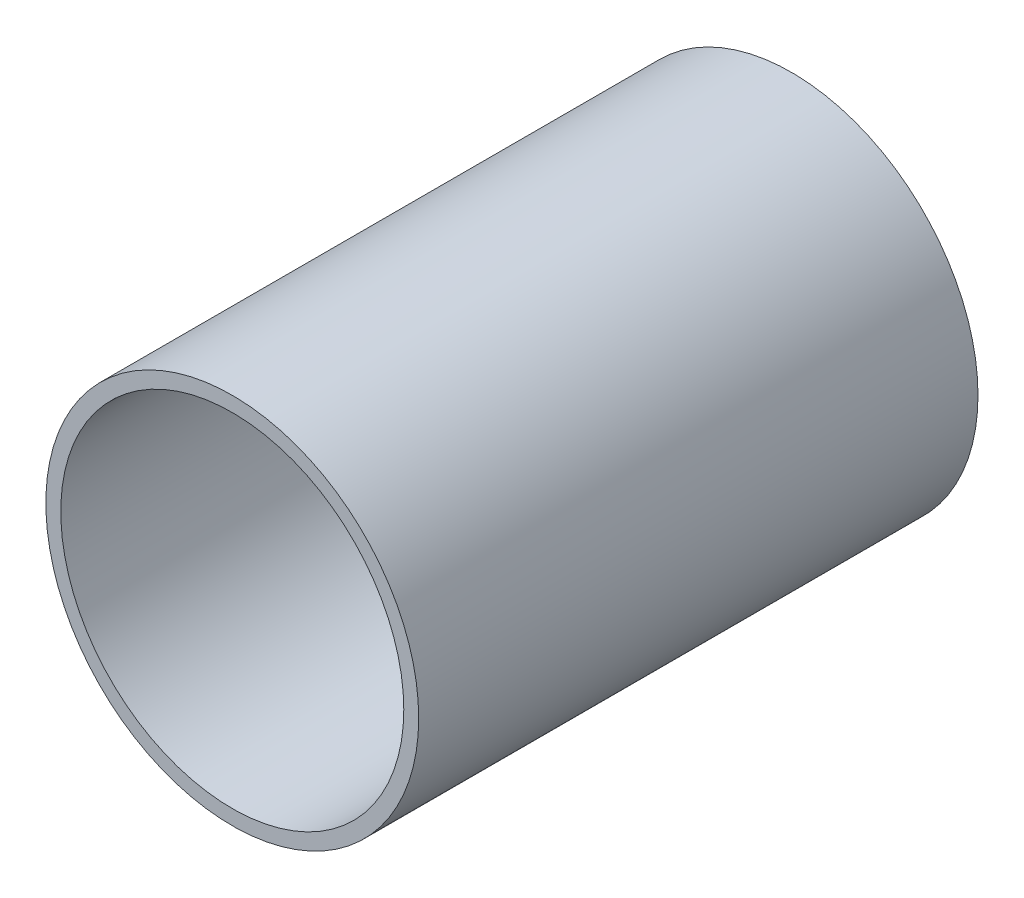
ISO-10303-21;
HEADER;
FILE_DESCRIPTION(('STEP AP214'),'2;1');
FILE_NAME('part.step','',(''),(''),'','','');
FILE_SCHEMA(('AUTOMOTIVE_DESIGN { 1 0 10303 214 1 1 1 1 }'));
ENDSEC;
DATA;
#1=APPLICATION_CONTEXT('core data for automotive mechanical design processes');
#2=APPLICATION_PROTOCOL_DEFINITION('international standard','automotive_design',2000,#1);
#3=PRODUCT_CONTEXT('',#1,'mechanical');
#4=PRODUCT('Part','Part','',(#3));
#5=PRODUCT_RELATED_PRODUCT_CATEGORY('part','',(#4));
#6=PRODUCT_DEFINITION_FORMATION('','',#4);
#7=PRODUCT_DEFINITION_CONTEXT('part definition',#1,'design');
#8=PRODUCT_DEFINITION('design','',#6,#7);
#9=PRODUCT_DEFINITION_SHAPE('','',#8);
#10=(LENGTH_UNIT() NAMED_UNIT(*) SI_UNIT(.MILLI.,.METRE.));
#11=(NAMED_UNIT(*) PLANE_ANGLE_UNIT() SI_UNIT($,.RADIAN.));
#12=(NAMED_UNIT(*) SI_UNIT($,.STERADIAN.) SOLID_ANGLE_UNIT());
#13=UNCERTAINTY_MEASURE_WITH_UNIT(LENGTH_MEASURE(1.E-05),#10,'distance_accuracy_value','');
#14=(GEOMETRIC_REPRESENTATION_CONTEXT(3) GLOBAL_UNCERTAINTY_ASSIGNED_CONTEXT((#13)) GLOBAL_UNIT_ASSIGNED_CONTEXT((#10,
#11,#12)) REPRESENTATION_CONTEXT('',''));
#15=CARTESIAN_POINT('',(0.,0.,0.));
#16=DIRECTION('',(0.,0.,1.));
#17=DIRECTION('',(1.,0.,0.));
#18=AXIS2_PLACEMENT_3D('',#15,#16,#17);
#19=CARTESIAN_POINT('',(0.,0.,30.));
#20=DIRECTION('',(0.,0.,-1.));
#21=DIRECTION('',(-1.,0.,0.));
#22=AXIS2_PLACEMENT_3D('',#19,#20,#21);
#23=CYLINDRICAL_SURFACE('',#22,10.);
#24=CARTESIAN_POINT('',(0.,0.,30.));
#25=DIRECTION('',(0.,0.,1.));
#26=DIRECTION('',(1.,0.,0.));
#27=AXIS2_PLACEMENT_3D('',#24,#25,#26);
#28=CIRCLE('',#27,10.);
#29=CARTESIAN_POINT('',(10.,0.,30.));
#30=VERTEX_POINT('',#29);
#31=EDGE_CURVE('E10',#30,#30,#28,.T.);
#32=ORIENTED_EDGE('',*,*,#31,.F.);
#33=EDGE_LOOP('',(#32));
#34=FACE_BOUND('',#33,.T.);
#35=CARTESIAN_POINT('',(0.,0.,0.));
#36=DIRECTION('',(0.,0.,1.));
#37=DIRECTION('',(1.,0.,0.));
#38=AXIS2_PLACEMENT_3D('',#35,#36,#37);
#39=CIRCLE('',#38,10.);
#40=CARTESIAN_POINT('',(10.,0.,0.));
#41=VERTEX_POINT('',#40);
#42=EDGE_CURVE('E42',#41,#41,#39,.T.);
#43=ORIENTED_EDGE('',*,*,#42,.T.);
#44=EDGE_LOOP('',(#43));
#45=FACE_BOUND('',#44,.T.);
#46=ADVANCED_FACE('F35',(#34,#45),#23,.T.);
#47=CARTESIAN_POINT('',(0.,0.,30.));
#48=DIRECTION('',(0.,0.,1.));
#49=DIRECTION('',(1.,0.,0.));
#50=AXIS2_PLACEMENT_3D('',#47,#48,#49);
#51=PLANE('',#50);
#52=CARTESIAN_POINT('',(0.,0.,30.));
#53=DIRECTION('',(0.,0.,1.));
#54=DIRECTION('',(1.,0.,0.));
#55=AXIS2_PLACEMENT_3D('',#52,#53,#54);
#56=CIRCLE('',#55,9.2);
#57=CARTESIAN_POINT('',(9.2,0.,30.));
#58=VERTEX_POINT('',#57);
#59=EDGE_CURVE('E81',#58,#58,#56,.T.);
#60=ORIENTED_EDGE('',*,*,#59,.F.);
#61=EDGE_LOOP('',(#60));
#62=FACE_BOUND('',#61,.T.);
#63=ORIENTED_EDGE('',*,*,#31,.T.);
#64=EDGE_LOOP('',(#63));
#65=FACE_BOUND('',#64,.T.);
#66=ADVANCED_FACE('F108',(#62,#65),#51,.T.);
#67=CARTESIAN_POINT('',(0.,0.,0.));
#68=DIRECTION('',(0.,0.,1.));
#69=DIRECTION('',(1.,0.,0.));
#70=AXIS2_PLACEMENT_3D('',#67,#68,#69);
#71=PLANE('',#70);
#72=CARTESIAN_POINT('',(0.,-5.,0.));
#73=DIRECTION('',(0.,0.,1.));
#74=DIRECTION('',(1.,0.,0.));
#75=AXIS2_PLACEMENT_3D('',#72,#73,#74);
#76=CIRCLE('',#75,0.5);
#77=CARTESIAN_POINT('',(0.499999999999983,-5.,0.));
#78=VERTEX_POINT('',#77);
#79=EDGE_CURVE('E57',#78,#78,#76,.T.);
#80=ORIENTED_EDGE('',*,*,#79,.T.);
#81=EDGE_LOOP('',(#80));
#82=FACE_BOUND('',#81,.T.);
#83=CARTESIAN_POINT('',(-5.,0.,0.));
#84=DIRECTION('',(0.,0.,1.));
#85=DIRECTION('',(1.,0.,0.));
#86=AXIS2_PLACEMENT_3D('',#83,#84,#85);
#87=CIRCLE('',#86,0.5);
#88=CARTESIAN_POINT('',(-4.5,0.,0.));
#89=VERTEX_POINT('',#88);
#90=EDGE_CURVE('E63',#89,#89,#87,.T.);
#91=ORIENTED_EDGE('',*,*,#90,.T.);
#92=EDGE_LOOP('',(#91));
#93=FACE_BOUND('',#92,.T.);
#94=CARTESIAN_POINT('',(0.,5.,0.));
#95=DIRECTION('',(0.,0.,1.));
#96=DIRECTION('',(1.,0.,0.));
#97=AXIS2_PLACEMENT_3D('',#94,#95,#96);
#98=CIRCLE('',#97,0.5);
#99=CARTESIAN_POINT('',(0.500000000000052,5.,0.));
#100=VERTEX_POINT('',#99);
#101=EDGE_CURVE('E60',#100,#100,#98,.T.);
#102=ORIENTED_EDGE('',*,*,#101,.T.);
#103=EDGE_LOOP('',(#102));
#104=FACE_BOUND('',#103,.T.);
#105=CARTESIAN_POINT('',(5.,0.,0.));
#106=DIRECTION('',(0.,0.,1.));
#107=DIRECTION('',(1.,0.,0.));
#108=AXIS2_PLACEMENT_3D('',#105,#106,#107);
#109=CIRCLE('',#108,0.5);
#110=CARTESIAN_POINT('',(5.5,0.,0.));
#111=VERTEX_POINT('',#110);
#112=EDGE_CURVE('E56',#111,#111,#109,.T.);
#113=ORIENTED_EDGE('',*,*,#112,.T.);
#114=EDGE_LOOP('',(#113));
#115=FACE_BOUND('',#114,.T.);
#116=CARTESIAN_POINT('',(0.,0.,0.));
#117=DIRECTION('',(0.,0.,1.));
#118=DIRECTION('',(1.,0.,0.));
#119=AXIS2_PLACEMENT_3D('',#116,#117,#118);
#120=CIRCLE('',#119,2.5);
#121=CARTESIAN_POINT('',(2.5,0.,0.));
#122=VERTEX_POINT('',#121);
#123=EDGE_CURVE('E50',#122,#122,#120,.T.);
#124=ORIENTED_EDGE('',*,*,#123,.T.);
#125=EDGE_LOOP('',(#124));
#126=FACE_BOUND('',#125,.T.);
#127=ORIENTED_EDGE('',*,*,#42,.F.);
#128=EDGE_LOOP('',(#127));
#129=FACE_BOUND('',#128,.T.);
#130=ADVANCED_FACE('F94',(#82,#93,#104,#115,#126,#129),#71,.F.);
#131=CARTESIAN_POINT('',(0.,0.,-2.));
#132=DIRECTION('',(0.,0.,1.));
#133=DIRECTION('',(1.,0.,0.));
#134=AXIS2_PLACEMENT_3D('',#131,#132,#133);
#135=CYLINDRICAL_SURFACE('',#134,2.5);
#136=CARTESIAN_POINT('',(0.,0.,-2.));
#137=DIRECTION('',(0.,0.,1.));
#138=DIRECTION('',(1.,0.,0.));
#139=AXIS2_PLACEMENT_3D('',#136,#137,#138);
#140=CIRCLE('',#139,2.5);
#141=CARTESIAN_POINT('',(2.5,0.,-2.));
#142=VERTEX_POINT('',#141);
#143=EDGE_CURVE('E47',#142,#142,#140,.T.);
#144=ORIENTED_EDGE('',*,*,#143,.T.);
#145=EDGE_LOOP('',(#144));
#146=FACE_BOUND('',#145,.T.);
#147=ORIENTED_EDGE('',*,*,#123,.F.);
#148=EDGE_LOOP('',(#147));
#149=FACE_BOUND('',#148,.T.);
#150=ADVANCED_FACE('F97',(#146,#149),#135,.T.);
#151=CARTESIAN_POINT('',(0.,0.,-2.));
#152=DIRECTION('',(0.,0.,1.));
#153=DIRECTION('',(1.,0.,0.));
#154=AXIS2_PLACEMENT_3D('',#151,#152,#153);
#155=PLANE('',#154);
#156=CARTESIAN_POINT('',(0.,0.,-2.));
#157=DIRECTION('',(0.,0.,1.));
#158=DIRECTION('',(1.,0.,0.));
#159=AXIS2_PLACEMENT_3D('',#156,#157,#158);
#160=CIRCLE('',#159,1.7);
#161=CARTESIAN_POINT('',(1.7,0.,-2.));
#162=VERTEX_POINT('',#161);
#163=EDGE_CURVE('E82',#162,#162,#160,.T.);
#164=ORIENTED_EDGE('',*,*,#163,.T.);
#165=EDGE_LOOP('',(#164));
#166=FACE_BOUND('',#165,.T.);
#167=ORIENTED_EDGE('',*,*,#143,.F.);
#168=EDGE_LOOP('',(#167));
#169=FACE_BOUND('',#168,.T.);
#170=ADVANCED_FACE('F99',(#166,#169),#155,.F.);
#171=CARTESIAN_POINT('',(0.,0.,30.));
#172=DIRECTION('',(0.,0.,-1.));
#173=DIRECTION('',(-1.,0.,0.));
#174=AXIS2_PLACEMENT_3D('',#171,#172,#173);
#175=CYLINDRICAL_SURFACE('',#174,9.2);
#176=ORIENTED_EDGE('',*,*,#59,.T.);
#177=EDGE_LOOP('',(#176));
#178=FACE_BOUND('',#177,.T.);
#179=CARTESIAN_POINT('',(0.,0.,0.799999999999999));
#180=DIRECTION('',(0.,0.,1.));
#181=DIRECTION('',(1.,0.,0.));
#182=AXIS2_PLACEMENT_3D('',#179,#180,#181);
#183=CIRCLE('',#182,9.2);
#184=CARTESIAN_POINT('',(9.2,0.,0.799999999999999));
#185=VERTEX_POINT('',#184);
#186=EDGE_CURVE('E78',#185,#185,#183,.T.);
#187=ORIENTED_EDGE('',*,*,#186,.F.);
#188=EDGE_LOOP('',(#187));
#189=FACE_BOUND('',#188,.T.);
#190=ADVANCED_FACE('F105',(#178,#189),#175,.F.);
#191=CARTESIAN_POINT('',(0.,0.,0.8));
#192=DIRECTION('',(0.,0.,1.));
#193=DIRECTION('',(1.,0.,0.));
#194=AXIS2_PLACEMENT_3D('',#191,#192,#193);
#195=PLANE('',#194);
#196=CARTESIAN_POINT('',(0.,-5.,0.8));
#197=DIRECTION('',(0.,0.,1.));
#198=DIRECTION('',(1.,0.,0.));
#199=AXIS2_PLACEMENT_3D('',#196,#197,#198);
#200=CIRCLE('',#199,0.5);
#201=CARTESIAN_POINT('',(0.499999999999983,-5.,0.8));
#202=VERTEX_POINT('',#201);
#203=EDGE_CURVE('E38',#202,#202,#200,.T.);
#204=ORIENTED_EDGE('',*,*,#203,.F.);
#205=EDGE_LOOP('',(#204));
#206=FACE_BOUND('',#205,.T.);
#207=CARTESIAN_POINT('',(-5.,0.,0.8));
#208=DIRECTION('',(0.,0.,1.));
#209=DIRECTION('',(1.,0.,0.));
#210=AXIS2_PLACEMENT_3D('',#207,#208,#209);
#211=CIRCLE('',#210,0.5);
#212=CARTESIAN_POINT('',(-4.5,0.,0.8));
#213=VERTEX_POINT('',#212);
#214=EDGE_CURVE('E61',#213,#213,#211,.T.);
#215=ORIENTED_EDGE('',*,*,#214,.F.);
#216=EDGE_LOOP('',(#215));
#217=FACE_BOUND('',#216,.T.);
#218=CARTESIAN_POINT('',(0.,5.,0.8));
#219=DIRECTION('',(0.,0.,1.));
#220=DIRECTION('',(1.,0.,0.));
#221=AXIS2_PLACEMENT_3D('',#218,#219,#220);
#222=CIRCLE('',#221,0.5);
#223=CARTESIAN_POINT('',(0.500000000000052,5.,0.8));
#224=VERTEX_POINT('',#223);
#225=EDGE_CURVE('E58',#224,#224,#222,.T.);
#226=ORIENTED_EDGE('',*,*,#225,.F.);
#227=EDGE_LOOP('',(#226));
#228=FACE_BOUND('',#227,.T.);
#229=CARTESIAN_POINT('',(5.,0.,0.8));
#230=DIRECTION('',(0.,0.,1.));
#231=DIRECTION('',(1.,0.,0.));
#232=AXIS2_PLACEMENT_3D('',#229,#230,#231);
#233=CIRCLE('',#232,0.5);
#234=CARTESIAN_POINT('',(5.5,0.,0.8));
#235=VERTEX_POINT('',#234);
#236=EDGE_CURVE('E53',#235,#235,#233,.T.);
#237=ORIENTED_EDGE('',*,*,#236,.F.);
#238=EDGE_LOOP('',(#237));
#239=FACE_BOUND('',#238,.T.);
#240=CARTESIAN_POINT('',(0.,0.,0.8));
#241=DIRECTION('',(0.,0.,1.));
#242=DIRECTION('',(1.,0.,0.));
#243=AXIS2_PLACEMENT_3D('',#240,#241,#242);
#244=CIRCLE('',#243,1.7);
#245=CARTESIAN_POINT('',(1.7,0.,0.8));
#246=VERTEX_POINT('',#245);
#247=EDGE_CURVE('E77',#246,#246,#244,.T.);
#248=ORIENTED_EDGE('',*,*,#247,.F.);
#249=EDGE_LOOP('',(#248));
#250=FACE_BOUND('',#249,.T.);
#251=ORIENTED_EDGE('',*,*,#186,.T.);
#252=EDGE_LOOP('',(#251));
#253=FACE_BOUND('',#252,.T.);
#254=ADVANCED_FACE('F125',(#206,#217,#228,#239,#250,#253),#195,.T.);
#255=CARTESIAN_POINT('',(0.,0.,-2.));
#256=DIRECTION('',(0.,0.,1.));
#257=DIRECTION('',(1.,0.,0.));
#258=AXIS2_PLACEMENT_3D('',#255,#256,#257);
#259=CYLINDRICAL_SURFACE('',#258,1.7);
#260=ORIENTED_EDGE('',*,*,#163,.F.);
#261=EDGE_LOOP('',(#260));
#262=FACE_BOUND('',#261,.T.);
#263=ORIENTED_EDGE('',*,*,#247,.T.);
#264=EDGE_LOOP('',(#263));
#265=FACE_BOUND('',#264,.T.);
#266=ADVANCED_FACE('F130',(#262,#265),#259,.F.);
#267=CARTESIAN_POINT('',(5.,0.,-2.));
#268=DIRECTION('',(0.,0.,1.));
#269=DIRECTION('',(1.,0.,0.));
#270=AXIS2_PLACEMENT_3D('',#267,#268,#269);
#271=CYLINDRICAL_SURFACE('',#270,0.5);
#272=ORIENTED_EDGE('',*,*,#236,.T.);
#273=EDGE_LOOP('',(#272));
#274=FACE_BOUND('',#273,.T.);
#275=ORIENTED_EDGE('',*,*,#112,.F.);
#276=EDGE_LOOP('',(#275));
#277=FACE_BOUND('',#276,.T.);
#278=ADVANCED_FACE('F136',(#274,#277),#271,.F.);
#279=CARTESIAN_POINT('',(0.,5.,-2.));
#280=DIRECTION('',(0.,0.,1.));
#281=DIRECTION('',(1.,0.,0.));
#282=AXIS2_PLACEMENT_3D('',#279,#280,#281);
#283=CYLINDRICAL_SURFACE('',#282,0.5);
#284=ORIENTED_EDGE('',*,*,#225,.T.);
#285=EDGE_LOOP('',(#284));
#286=FACE_BOUND('',#285,.T.);
#287=ORIENTED_EDGE('',*,*,#101,.F.);
#288=EDGE_LOOP('',(#287));
#289=FACE_BOUND('',#288,.T.);
#290=ADVANCED_FACE('F144',(#286,#289),#283,.F.);
#291=CARTESIAN_POINT('',(-5.,0.,-2.));
#292=DIRECTION('',(0.,0.,1.));
#293=DIRECTION('',(1.,0.,0.));
#294=AXIS2_PLACEMENT_3D('',#291,#292,#293);
#295=CYLINDRICAL_SURFACE('',#294,0.5);
#296=ORIENTED_EDGE('',*,*,#214,.T.);
#297=EDGE_LOOP('',(#296));
#298=FACE_BOUND('',#297,.T.);
#299=ORIENTED_EDGE('',*,*,#90,.F.);
#300=EDGE_LOOP('',(#299));
#301=FACE_BOUND('',#300,.T.);
#302=ADVANCED_FACE('F148',(#298,#301),#295,.F.);
#303=CARTESIAN_POINT('',(0.,-5.,-2.));
#304=DIRECTION('',(0.,0.,1.));
#305=DIRECTION('',(1.,0.,0.));
#306=AXIS2_PLACEMENT_3D('',#303,#304,#305);
#307=CYLINDRICAL_SURFACE('',#306,0.5);
#308=ORIENTED_EDGE('',*,*,#203,.T.);
#309=EDGE_LOOP('',(#308));
#310=FACE_BOUND('',#309,.T.);
#311=ORIENTED_EDGE('',*,*,#79,.F.);
#312=EDGE_LOOP('',(#311));
#313=FACE_BOUND('',#312,.T.);
#314=ADVANCED_FACE('F152',(#310,#313),#307,.F.);
#315=CLOSED_SHELL('',(#46,#66,#130,#150,#170,#190,#254,#266,#278,#290,#302,#314));
#316=MANIFOLD_SOLID_BREP('B2',#315);
#317=ADVANCED_BREP_SHAPE_REPRESENTATION('',(#18,#316),#14);
#318=SHAPE_DEFINITION_REPRESENTATION(#9,#317);
ENDSEC;
END-ISO-10303-21;
